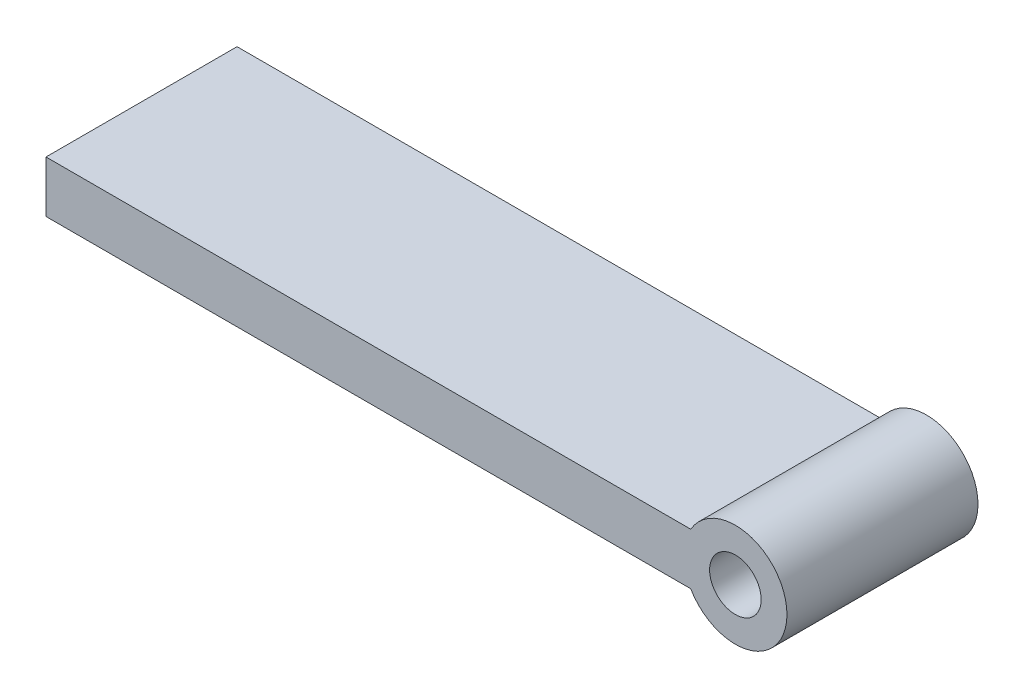
ISO-10303-21;
HEADER;
FILE_DESCRIPTION(('STEP AP214'),'2;1');
FILE_NAME('part.step','',(''),(''),'','','');
FILE_SCHEMA(('AUTOMOTIVE_DESIGN { 1 0 10303 214 1 1 1 1 }'));
ENDSEC;
DATA;
#1=APPLICATION_CONTEXT('core data for automotive mechanical design processes');
#2=APPLICATION_PROTOCOL_DEFINITION('international standard','automotive_design',2000,#1);
#3=PRODUCT_CONTEXT('',#1,'mechanical');
#4=PRODUCT('Part','Part','',(#3));
#5=PRODUCT_RELATED_PRODUCT_CATEGORY('part','',(#4));
#6=PRODUCT_DEFINITION_FORMATION('','',#4);
#7=PRODUCT_DEFINITION_CONTEXT('part definition',#1,'design');
#8=PRODUCT_DEFINITION('design','',#6,#7);
#9=PRODUCT_DEFINITION_SHAPE('','',#8);
#10=(LENGTH_UNIT() NAMED_UNIT(*) SI_UNIT(.MILLI.,.METRE.));
#11=(NAMED_UNIT(*) PLANE_ANGLE_UNIT() SI_UNIT($,.RADIAN.));
#12=(NAMED_UNIT(*) SI_UNIT($,.STERADIAN.) SOLID_ANGLE_UNIT());
#13=UNCERTAINTY_MEASURE_WITH_UNIT(LENGTH_MEASURE(1.E-05),#10,'distance_accuracy_value','');
#14=(GEOMETRIC_REPRESENTATION_CONTEXT(3) GLOBAL_UNCERTAINTY_ASSIGNED_CONTEXT((#13)) GLOBAL_UNIT_ASSIGNED_CONTEXT((#10,
#11,#12)) REPRESENTATION_CONTEXT('',''));
#15=CARTESIAN_POINT('',(0.,0.,0.));
#16=DIRECTION('',(0.,0.,1.));
#17=DIRECTION('',(1.,0.,0.));
#18=AXIS2_PLACEMENT_3D('',#15,#16,#17);
#19=CARTESIAN_POINT('',(80.2,3.,22.225));
#20=DIRECTION('',(0.,0.,1.));
#21=DIRECTION('',(1.,0.,0.));
#22=AXIS2_PLACEMENT_3D('',#19,#20,#21);
#23=PLANE('',#22);
#24=DIRECTION('',(1.,0.,0.));
#25=VECTOR('',#24,1.);
#26=CARTESIAN_POINT('',(0.,0.,22.225));
#27=LINE('',#26,#25);
#28=CARTESIAN_POINT('',(0.,0.,22.225));
#29=VERTEX_POINT('',#28);
#30=CARTESIAN_POINT('',(75.0038475772934,0.,22.225));
#31=VERTEX_POINT('',#30);
#32=EDGE_CURVE('E92',#29,#31,#27,.T.);
#33=ORIENTED_EDGE('',*,*,#32,.T.);
#34=CARTESIAN_POINT('',(80.2,3.,22.225));
#35=DIRECTION('',(0.,0.,1.));
#36=DIRECTION('',(1.,0.,0.));
#37=AXIS2_PLACEMENT_3D('',#34,#35,#36);
#38=CIRCLE('',#37,6.);
#39=CARTESIAN_POINT('',(75.0038475772934,6.,22.225));
#40=VERTEX_POINT('',#39);
#41=EDGE_CURVE('E87',#31,#40,#38,.T.);
#42=ORIENTED_EDGE('',*,*,#41,.T.);
#43=DIRECTION('',(-1.,0.,0.));
#44=VECTOR('',#43,1.);
#45=CARTESIAN_POINT('',(0.,6.,22.225));
#46=LINE('',#45,#44);
#47=CARTESIAN_POINT('',(0.,6.,22.225));
#48=VERTEX_POINT('',#47);
#49=EDGE_CURVE('E90',#40,#48,#46,.T.);
#50=ORIENTED_EDGE('',*,*,#49,.T.);
#51=DIRECTION('',(0.,-1.,0.));
#52=VECTOR('',#51,1.);
#53=CARTESIAN_POINT('',(0.,0.,22.225));
#54=LINE('',#53,#52);
#55=EDGE_CURVE('E57',#48,#29,#54,.T.);
#56=ORIENTED_EDGE('',*,*,#55,.T.);
#57=EDGE_LOOP('',(#33,#42,#50,#56));
#58=FACE_BOUND('',#57,.T.);
#59=CARTESIAN_POINT('',(80.2,3.,22.225));
#60=DIRECTION('',(0.,0.,1.));
#61=DIRECTION('',(1.,0.,0.));
#62=AXIS2_PLACEMENT_3D('',#59,#60,#61);
#63=CIRCLE('',#62,3.00000000000001);
#64=CARTESIAN_POINT('',(83.2,3.,22.225));
#65=VERTEX_POINT('',#64);
#66=EDGE_CURVE('E112',#65,#65,#63,.T.);
#67=ORIENTED_EDGE('',*,*,#66,.F.);
#68=EDGE_LOOP('',(#67));
#69=FACE_BOUND('',#68,.T.);
#70=ADVANCED_FACE('F39',(#58,#69),#23,.T.);
#71=CARTESIAN_POINT('',(80.2,3.,0.));
#72=DIRECTION('',(0.,0.,1.));
#73=DIRECTION('',(1.,0.,0.));
#74=AXIS2_PLACEMENT_3D('',#71,#72,#73);
#75=PLANE('',#74);
#76=DIRECTION('',(1.,0.,0.));
#77=VECTOR('',#76,1.);
#78=CARTESIAN_POINT('',(0.,0.,0.));
#79=LINE('',#78,#77);
#80=CARTESIAN_POINT('',(0.,0.,0.));
#81=VERTEX_POINT('',#80);
#82=CARTESIAN_POINT('',(75.0038475772934,0.,0.));
#83=VERTEX_POINT('',#82);
#84=EDGE_CURVE('E108',#81,#83,#79,.T.);
#85=ORIENTED_EDGE('',*,*,#84,.F.);
#86=DIRECTION('',(0.,-1.,0.));
#87=VECTOR('',#86,1.);
#88=CARTESIAN_POINT('',(0.,0.,0.));
#89=LINE('',#88,#87);
#90=CARTESIAN_POINT('',(0.,6.,0.));
#91=VERTEX_POINT('',#90);
#92=EDGE_CURVE('E80',#91,#81,#89,.T.);
#93=ORIENTED_EDGE('',*,*,#92,.F.);
#94=DIRECTION('',(-1.,0.,0.));
#95=VECTOR('',#94,1.);
#96=CARTESIAN_POINT('',(0.,6.,0.));
#97=LINE('',#96,#95);
#98=CARTESIAN_POINT('',(75.0038475772934,6.,0.));
#99=VERTEX_POINT('',#98);
#100=EDGE_CURVE('E74',#99,#91,#97,.T.);
#101=ORIENTED_EDGE('',*,*,#100,.F.);
#102=CARTESIAN_POINT('',(80.2,3.,0.));
#103=DIRECTION('',(0.,0.,1.));
#104=DIRECTION('',(1.,0.,0.));
#105=AXIS2_PLACEMENT_3D('',#102,#103,#104);
#106=CIRCLE('',#105,6.);
#107=EDGE_CURVE('E97',#83,#99,#106,.T.);
#108=ORIENTED_EDGE('',*,*,#107,.F.);
#109=EDGE_LOOP('',(#85,#93,#101,#108));
#110=FACE_BOUND('',#109,.T.);
#111=CARTESIAN_POINT('',(80.2,3.,0.));
#112=DIRECTION('',(0.,0.,1.));
#113=DIRECTION('',(1.,0.,0.));
#114=AXIS2_PLACEMENT_3D('',#111,#112,#113);
#115=CIRCLE('',#114,3.00000000000001);
#116=CARTESIAN_POINT('',(83.2,3.,0.));
#117=VERTEX_POINT('',#116);
#118=EDGE_CURVE('E130',#117,#117,#115,.T.);
#119=ORIENTED_EDGE('',*,*,#118,.T.);
#120=EDGE_LOOP('',(#119));
#121=FACE_BOUND('',#120,.T.);
#122=ADVANCED_FACE('F125',(#110,#121),#75,.F.);
#123=CARTESIAN_POINT('',(0.,0.,22.225));
#124=DIRECTION('',(0.,1.,0.));
#125=DIRECTION('',(-1.,0.,0.));
#126=AXIS2_PLACEMENT_3D('',#123,#124,#125);
#127=PLANE('',#126);
#128=ORIENTED_EDGE('',*,*,#84,.T.);
#129=DIRECTION('',(0.,0.,-1.));
#130=VECTOR('',#129,1.);
#131=CARTESIAN_POINT('',(75.0038475772934,0.,22.225));
#132=LINE('',#131,#130);
#133=EDGE_CURVE('E11',#31,#83,#132,.T.);
#134=ORIENTED_EDGE('',*,*,#133,.F.);
#135=ORIENTED_EDGE('',*,*,#32,.F.);
#136=DIRECTION('',(0.,0.,-1.));
#137=VECTOR('',#136,1.);
#138=CARTESIAN_POINT('',(0.,0.,22.225));
#139=LINE('',#138,#137);
#140=EDGE_CURVE('E104',#29,#81,#139,.T.);
#141=ORIENTED_EDGE('',*,*,#140,.T.);
#142=EDGE_LOOP('',(#128,#134,#135,#141));
#143=FACE_BOUND('',#142,.T.);
#144=ADVANCED_FACE('F41',(#143),#127,.F.);
#145=CARTESIAN_POINT('',(80.2,3.,22.225));
#146=DIRECTION('',(0.,0.,-1.));
#147=DIRECTION('',(-1.,0.,0.));
#148=AXIS2_PLACEMENT_3D('',#145,#146,#147);
#149=CYLINDRICAL_SURFACE('',#148,6.);
#150=ORIENTED_EDGE('',*,*,#107,.T.);
#151=DIRECTION('',(0.,0.,-1.));
#152=VECTOR('',#151,1.);
#153=CARTESIAN_POINT('',(75.0038475772934,6.,22.225));
#154=LINE('',#153,#152);
#155=EDGE_CURVE('E49',#40,#99,#154,.T.);
#156=ORIENTED_EDGE('',*,*,#155,.F.);
#157=ORIENTED_EDGE('',*,*,#41,.F.);
#158=ORIENTED_EDGE('',*,*,#133,.T.);
#159=EDGE_LOOP('',(#150,#156,#157,#158));
#160=FACE_BOUND('',#159,.T.);
#161=ADVANCED_FACE('F96',(#160),#149,.T.);
#162=CARTESIAN_POINT('',(0.,6.,22.225));
#163=DIRECTION('',(0.,-1.,0.));
#164=DIRECTION('',(1.,0.,0.));
#165=AXIS2_PLACEMENT_3D('',#162,#163,#164);
#166=PLANE('',#165);
#167=ORIENTED_EDGE('',*,*,#100,.T.);
#168=DIRECTION('',(0.,0.,-1.));
#169=VECTOR('',#168,1.);
#170=CARTESIAN_POINT('',(0.,6.,22.225));
#171=LINE('',#170,#169);
#172=EDGE_CURVE('E99',#48,#91,#171,.T.);
#173=ORIENTED_EDGE('',*,*,#172,.F.);
#174=ORIENTED_EDGE('',*,*,#49,.F.);
#175=ORIENTED_EDGE('',*,*,#155,.T.);
#176=EDGE_LOOP('',(#167,#173,#174,#175));
#177=FACE_BOUND('',#176,.T.);
#178=ADVANCED_FACE('F100',(#177),#166,.F.);
#179=CARTESIAN_POINT('',(0.,0.,22.225));
#180=DIRECTION('',(1.,0.,0.));
#181=DIRECTION('',(0.,0.,-1.));
#182=AXIS2_PLACEMENT_3D('',#179,#180,#181);
#183=PLANE('',#182);
#184=ORIENTED_EDGE('',*,*,#92,.T.);
#185=ORIENTED_EDGE('',*,*,#140,.F.);
#186=ORIENTED_EDGE('',*,*,#55,.F.);
#187=ORIENTED_EDGE('',*,*,#172,.T.);
#188=EDGE_LOOP('',(#184,#185,#186,#187));
#189=FACE_BOUND('',#188,.T.);
#190=ADVANCED_FACE('F122',(#189),#183,.F.);
#191=CARTESIAN_POINT('',(80.2,3.,22.225));
#192=DIRECTION('',(0.,0.,-1.));
#193=DIRECTION('',(-1.,0.,0.));
#194=AXIS2_PLACEMENT_3D('',#191,#192,#193);
#195=CYLINDRICAL_SURFACE('',#194,3.00000000000001);
#196=ORIENTED_EDGE('',*,*,#66,.T.);
#197=EDGE_LOOP('',(#196));
#198=FACE_BOUND('',#197,.T.);
#199=ORIENTED_EDGE('',*,*,#118,.F.);
#200=EDGE_LOOP('',(#199));
#201=FACE_BOUND('',#200,.T.);
#202=ADVANCED_FACE('F138',(#198,#201),#195,.F.);
#203=CLOSED_SHELL('',(#70,#122,#144,#161,#178,#190,#202));
#204=MANIFOLD_SOLID_BREP('B2',#203);
#205=ADVANCED_BREP_SHAPE_REPRESENTATION('',(#18,#204),#14);
#206=SHAPE_DEFINITION_REPRESENTATION(#9,#205);
ENDSEC;
END-ISO-10303-21;
